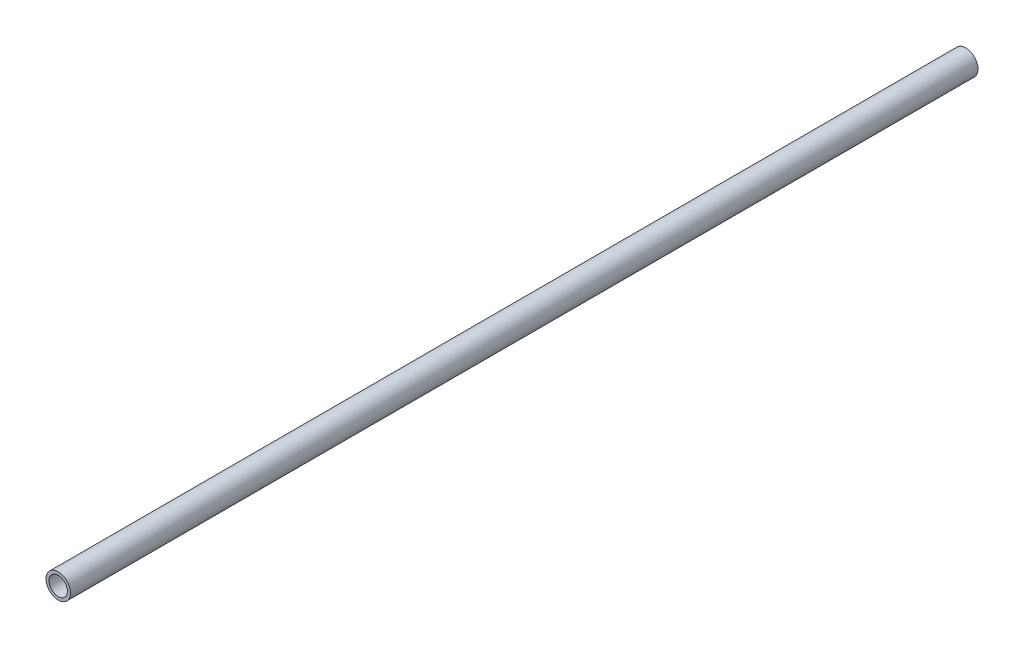
ISO-10303-21;
HEADER;
FILE_DESCRIPTION(('STEP AP214'),'2;1');
FILE_NAME('part.step','',(''),(''),'','','');
FILE_SCHEMA(('AUTOMOTIVE_DESIGN { 1 0 10303 214 1 1 1 1 }'));
ENDSEC;
DATA;
#1=APPLICATION_CONTEXT('core data for automotive mechanical design processes');
#2=APPLICATION_PROTOCOL_DEFINITION('international standard','automotive_design',2000,#1);
#3=PRODUCT_CONTEXT('',#1,'mechanical');
#4=PRODUCT('Part','Part','',(#3));
#5=PRODUCT_RELATED_PRODUCT_CATEGORY('part','',(#4));
#6=PRODUCT_DEFINITION_FORMATION('','',#4);
#7=PRODUCT_DEFINITION_CONTEXT('part definition',#1,'design');
#8=PRODUCT_DEFINITION('design','',#6,#7);
#9=PRODUCT_DEFINITION_SHAPE('','',#8);
#10=(LENGTH_UNIT() NAMED_UNIT(*) SI_UNIT(.MILLI.,.METRE.));
#11=(NAMED_UNIT(*) PLANE_ANGLE_UNIT() SI_UNIT($,.RADIAN.));
#12=(NAMED_UNIT(*) SI_UNIT($,.STERADIAN.) SOLID_ANGLE_UNIT());
#13=UNCERTAINTY_MEASURE_WITH_UNIT(LENGTH_MEASURE(1.E-05),#10,'distance_accuracy_value','');
#14=(GEOMETRIC_REPRESENTATION_CONTEXT(3) GLOBAL_UNCERTAINTY_ASSIGNED_CONTEXT((#13)) GLOBAL_UNIT_ASSIGNED_CONTEXT((#10,
#11,#12)) REPRESENTATION_CONTEXT('',''));
#15=CARTESIAN_POINT('',(0.,0.,0.));
#16=DIRECTION('',(0.,0.,1.));
#17=DIRECTION('',(1.,0.,0.));
#18=AXIS2_PLACEMENT_3D('',#15,#16,#17);
#19=CARTESIAN_POINT('',(0.,0.,939.8));
#20=DIRECTION('',(0.,0.,1.));
#21=DIRECTION('',(1.,0.,0.));
#22=AXIS2_PLACEMENT_3D('',#19,#20,#21);
#23=PLANE('',#22);
#24=CARTESIAN_POINT('',(0.,0.,939.8));
#25=DIRECTION('',(0.,0.,1.));
#26=DIRECTION('',(1.,0.,0.));
#27=AXIS2_PLACEMENT_3D('',#24,#25,#26);
#28=CIRCLE('',#27,12.7);
#29=CARTESIAN_POINT('',(12.7,0.,939.8));
#30=VERTEX_POINT('',#29);
#31=EDGE_CURVE('E10',#30,#30,#28,.T.);
#32=ORIENTED_EDGE('',*,*,#31,.T.);
#33=EDGE_LOOP('',(#32));
#34=FACE_BOUND('',#33,.T.);
#35=CARTESIAN_POINT('',(0.,0.,939.8));
#36=DIRECTION('',(0.,0.,1.));
#37=DIRECTION('',(1.,0.,0.));
#38=AXIS2_PLACEMENT_3D('',#35,#36,#37);
#39=CIRCLE('',#38,9.525);
#40=CARTESIAN_POINT('',(9.525,0.,939.8));
#41=VERTEX_POINT('',#40);
#42=EDGE_CURVE('E46',#41,#41,#39,.T.);
#43=ORIENTED_EDGE('',*,*,#42,.F.);
#44=EDGE_LOOP('',(#43));
#45=FACE_BOUND('',#44,.T.);
#46=ADVANCED_FACE('F35',(#34,#45),#23,.T.);
#47=CARTESIAN_POINT('',(0.,0.,0.));
#48=DIRECTION('',(0.,0.,1.));
#49=DIRECTION('',(1.,0.,0.));
#50=AXIS2_PLACEMENT_3D('',#47,#48,#49);
#51=PLANE('',#50);
#52=CARTESIAN_POINT('',(0.,0.,0.));
#53=DIRECTION('',(0.,0.,1.));
#54=DIRECTION('',(1.,0.,0.));
#55=AXIS2_PLACEMENT_3D('',#52,#53,#54);
#56=CIRCLE('',#55,12.7);
#57=CARTESIAN_POINT('',(12.7,0.,0.));
#58=VERTEX_POINT('',#57);
#59=EDGE_CURVE('E39',#58,#58,#56,.T.);
#60=ORIENTED_EDGE('',*,*,#59,.F.);
#61=EDGE_LOOP('',(#60));
#62=FACE_BOUND('',#61,.T.);
#63=CARTESIAN_POINT('',(0.,0.,0.));
#64=DIRECTION('',(0.,0.,1.));
#65=DIRECTION('',(1.,0.,0.));
#66=AXIS2_PLACEMENT_3D('',#63,#64,#65);
#67=CIRCLE('',#66,9.525);
#68=CARTESIAN_POINT('',(9.525,0.,0.));
#69=VERTEX_POINT('',#68);
#70=EDGE_CURVE('E48',#69,#69,#67,.T.);
#71=ORIENTED_EDGE('',*,*,#70,.T.);
#72=EDGE_LOOP('',(#71));
#73=FACE_BOUND('',#72,.T.);
#74=ADVANCED_FACE('F58',(#62,#73),#51,.F.);
#75=CARTESIAN_POINT('',(0.,0.,939.8));
#76=DIRECTION('',(0.,0.,-1.));
#77=DIRECTION('',(-1.,0.,0.));
#78=AXIS2_PLACEMENT_3D('',#75,#76,#77);
#79=CYLINDRICAL_SURFACE('',#78,12.7);
#80=ORIENTED_EDGE('',*,*,#31,.F.);
#81=EDGE_LOOP('',(#80));
#82=FACE_BOUND('',#81,.T.);
#83=ORIENTED_EDGE('',*,*,#59,.T.);
#84=EDGE_LOOP('',(#83));
#85=FACE_BOUND('',#84,.T.);
#86=ADVANCED_FACE('F37',(#82,#85),#79,.T.);
#87=CARTESIAN_POINT('',(0.,0.,939.8));
#88=DIRECTION('',(0.,0.,-1.));
#89=DIRECTION('',(-1.,0.,0.));
#90=AXIS2_PLACEMENT_3D('',#87,#88,#89);
#91=CYLINDRICAL_SURFACE('',#90,9.525);
#92=ORIENTED_EDGE('',*,*,#42,.T.);
#93=EDGE_LOOP('',(#92));
#94=FACE_BOUND('',#93,.T.);
#95=ORIENTED_EDGE('',*,*,#70,.F.);
#96=EDGE_LOOP('',(#95));
#97=FACE_BOUND('',#96,.T.);
#98=ADVANCED_FACE('F54',(#94,#97),#91,.F.);
#99=CLOSED_SHELL('',(#46,#74,#86,#98));
#100=MANIFOLD_SOLID_BREP('B2',#99);
#101=ADVANCED_BREP_SHAPE_REPRESENTATION('',(#18,#100),#14);
#102=SHAPE_DEFINITION_REPRESENTATION(#9,#101);
ENDSEC;
END-ISO-10303-21;
